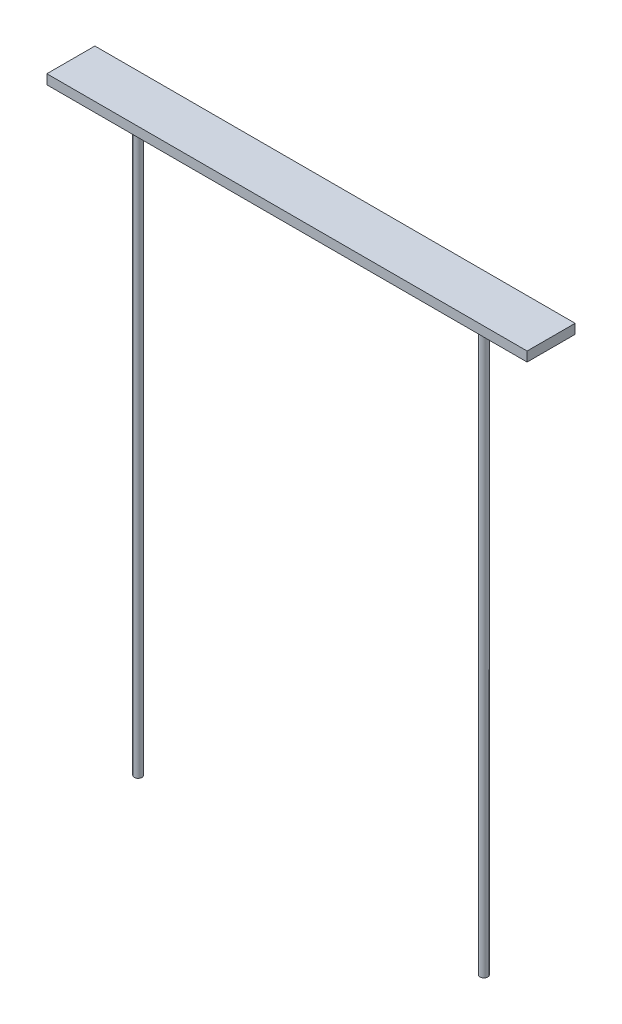
ISO-10303-21;
HEADER;
FILE_DESCRIPTION(('STEP AP214'),'2;1');
FILE_NAME('part.step','',(''),(''),'','','');
FILE_SCHEMA(('AUTOMOTIVE_DESIGN { 1 0 10303 214 1 1 1 1 }'));
ENDSEC;
DATA;
#1=APPLICATION_CONTEXT('core data for automotive mechanical design processes');
#2=APPLICATION_PROTOCOL_DEFINITION('international standard','automotive_design',2000,#1);
#3=PRODUCT_CONTEXT('',#1,'mechanical');
#4=PRODUCT('Part','Part','',(#3));
#5=PRODUCT_RELATED_PRODUCT_CATEGORY('part','',(#4));
#6=PRODUCT_DEFINITION_FORMATION('','',#4);
#7=PRODUCT_DEFINITION_CONTEXT('part definition',#1,'design');
#8=PRODUCT_DEFINITION('design','',#6,#7);
#9=PRODUCT_DEFINITION_SHAPE('','',#8);
#10=(LENGTH_UNIT() NAMED_UNIT(*) SI_UNIT(.MILLI.,.METRE.));
#11=(NAMED_UNIT(*) PLANE_ANGLE_UNIT() SI_UNIT($,.RADIAN.));
#12=(NAMED_UNIT(*) SI_UNIT($,.STERADIAN.) SOLID_ANGLE_UNIT());
#13=UNCERTAINTY_MEASURE_WITH_UNIT(LENGTH_MEASURE(1.E-05),#10,'distance_accuracy_value','');
#14=(GEOMETRIC_REPRESENTATION_CONTEXT(3) GLOBAL_UNCERTAINTY_ASSIGNED_CONTEXT((#13)) GLOBAL_UNIT_ASSIGNED_CONTEXT((#10,
#11,#12)) REPRESENTATION_CONTEXT('',''));
#15=CARTESIAN_POINT('',(0.,0.,0.));
#16=DIRECTION('',(0.,0.,1.));
#17=DIRECTION('',(1.,0.,0.));
#18=AXIS2_PLACEMENT_3D('',#15,#16,#17);
#19=CARTESIAN_POINT('',(250.,10.,-25.));
#20=DIRECTION('',(-1.,0.,0.));
#21=DIRECTION('',(0.,0.,1.));
#22=AXIS2_PLACEMENT_3D('',#19,#20,#21);
#23=PLANE('',#22);
#24=DIRECTION('',(0.,0.,-1.));
#25=VECTOR('',#24,1.);
#26=CARTESIAN_POINT('',(250.,0.,-25.));
#27=LINE('',#26,#25);
#28=CARTESIAN_POINT('',(250.,0.,25.));
#29=VERTEX_POINT('',#28);
#30=CARTESIAN_POINT('',(250.,0.,-25.));
#31=VERTEX_POINT('',#30);
#32=EDGE_CURVE('E103',#29,#31,#27,.T.);
#33=ORIENTED_EDGE('',*,*,#32,.T.);
#34=DIRECTION('',(0.,-1.,0.));
#35=VECTOR('',#34,1.);
#36=CARTESIAN_POINT('',(250.,10.,-25.));
#37=LINE('',#36,#35);
#38=CARTESIAN_POINT('',(250.,10.,-25.));
#39=VERTEX_POINT('',#38);
#40=EDGE_CURVE('E94',#39,#31,#37,.T.);
#41=ORIENTED_EDGE('',*,*,#40,.F.);
#42=DIRECTION('',(0.,0.,-1.));
#43=VECTOR('',#42,1.);
#44=CARTESIAN_POINT('',(250.,10.,-25.));
#45=LINE('',#44,#43);
#46=CARTESIAN_POINT('',(250.,10.,25.));
#47=VERTEX_POINT('',#46);
#48=EDGE_CURVE('E88',#47,#39,#45,.T.);
#49=ORIENTED_EDGE('',*,*,#48,.F.);
#50=DIRECTION('',(0.,-1.,0.));
#51=VECTOR('',#50,1.);
#52=CARTESIAN_POINT('',(250.,10.,25.));
#53=LINE('',#52,#51);
#54=EDGE_CURVE('E99',#47,#29,#53,.T.);
#55=ORIENTED_EDGE('',*,*,#54,.T.);
#56=EDGE_LOOP('',(#33,#41,#49,#55));
#57=FACE_BOUND('',#56,.T.);
#58=ADVANCED_FACE('F36',(#57),#23,.F.);
#59=CARTESIAN_POINT('',(-250.,10.,-25.));
#60=DIRECTION('',(0.,0.,1.));
#61=DIRECTION('',(1.,0.,0.));
#62=AXIS2_PLACEMENT_3D('',#59,#60,#61);
#63=PLANE('',#62);
#64=DIRECTION('',(-1.,0.,0.));
#65=VECTOR('',#64,1.);
#66=CARTESIAN_POINT('',(-250.,0.,-25.));
#67=LINE('',#66,#65);
#68=CARTESIAN_POINT('',(-250.,0.,-25.));
#69=VERTEX_POINT('',#68);
#70=EDGE_CURVE('E93',#31,#69,#67,.T.);
#71=ORIENTED_EDGE('',*,*,#70,.T.);
#72=DIRECTION('',(0.,-1.,0.));
#73=VECTOR('',#72,1.);
#74=CARTESIAN_POINT('',(-250.,10.,-25.));
#75=LINE('',#74,#73);
#76=CARTESIAN_POINT('',(-250.,10.,-25.));
#77=VERTEX_POINT('',#76);
#78=EDGE_CURVE('E91',#77,#69,#75,.T.);
#79=ORIENTED_EDGE('',*,*,#78,.F.);
#80=DIRECTION('',(-1.,0.,0.));
#81=VECTOR('',#80,1.);
#82=CARTESIAN_POINT('',(-250.,10.,-25.));
#83=LINE('',#82,#81);
#84=EDGE_CURVE('E83',#39,#77,#83,.T.);
#85=ORIENTED_EDGE('',*,*,#84,.F.);
#86=ORIENTED_EDGE('',*,*,#40,.T.);
#87=EDGE_LOOP('',(#71,#79,#85,#86));
#88=FACE_BOUND('',#87,.T.);
#89=ADVANCED_FACE('F92',(#88),#63,.F.);
#90=CARTESIAN_POINT('',(-250.,10.,-25.));
#91=DIRECTION('',(1.,0.,0.));
#92=DIRECTION('',(0.,0.,-1.));
#93=AXIS2_PLACEMENT_3D('',#90,#91,#92);
#94=PLANE('',#93);
#95=DIRECTION('',(0.,0.,1.));
#96=VECTOR('',#95,1.);
#97=CARTESIAN_POINT('',(-250.,0.,-25.));
#98=LINE('',#97,#96);
#99=CARTESIAN_POINT('',(-250.,0.,25.));
#100=VERTEX_POINT('',#99);
#101=EDGE_CURVE('E69',#69,#100,#98,.T.);
#102=ORIENTED_EDGE('',*,*,#101,.T.);
#103=DIRECTION('',(0.,-1.,0.));
#104=VECTOR('',#103,1.);
#105=CARTESIAN_POINT('',(-250.,10.,25.));
#106=LINE('',#105,#104);
#107=CARTESIAN_POINT('',(-250.,10.,25.));
#108=VERTEX_POINT('',#107);
#109=EDGE_CURVE('E95',#108,#100,#106,.T.);
#110=ORIENTED_EDGE('',*,*,#109,.F.);
#111=DIRECTION('',(0.,0.,1.));
#112=VECTOR('',#111,1.);
#113=CARTESIAN_POINT('',(-250.,10.,-25.));
#114=LINE('',#113,#112);
#115=EDGE_CURVE('E86',#77,#108,#114,.T.);
#116=ORIENTED_EDGE('',*,*,#115,.F.);
#117=ORIENTED_EDGE('',*,*,#78,.T.);
#118=EDGE_LOOP('',(#102,#110,#116,#117));
#119=FACE_BOUND('',#118,.T.);
#120=ADVANCED_FACE('F97',(#119),#94,.F.);
#121=CARTESIAN_POINT('',(-250.,10.,25.));
#122=DIRECTION('',(0.,0.,-1.));
#123=DIRECTION('',(-1.,0.,0.));
#124=AXIS2_PLACEMENT_3D('',#121,#122,#123);
#125=PLANE('',#124);
#126=DIRECTION('',(1.,0.,0.));
#127=VECTOR('',#126,1.);
#128=CARTESIAN_POINT('',(-250.,0.,25.));
#129=LINE('',#128,#127);
#130=EDGE_CURVE('E75',#100,#29,#129,.T.);
#131=ORIENTED_EDGE('',*,*,#130,.T.);
#132=ORIENTED_EDGE('',*,*,#54,.F.);
#133=DIRECTION('',(1.,0.,0.));
#134=VECTOR('',#133,1.);
#135=CARTESIAN_POINT('',(-250.,10.,25.));
#136=LINE('',#135,#134);
#137=EDGE_CURVE('E52',#108,#47,#136,.T.);
#138=ORIENTED_EDGE('',*,*,#137,.F.);
#139=ORIENTED_EDGE('',*,*,#109,.T.);
#140=EDGE_LOOP('',(#131,#132,#138,#139));
#141=FACE_BOUND('',#140,.T.);
#142=ADVANCED_FACE('F124',(#141),#125,.F.);
#143=CARTESIAN_POINT('',(0.,10.,0.));
#144=DIRECTION('',(0.,1.,0.));
#145=DIRECTION('',(0.,0.,1.));
#146=AXIS2_PLACEMENT_3D('',#143,#144,#145);
#147=PLANE('',#146);
#148=ORIENTED_EDGE('',*,*,#48,.T.);
#149=ORIENTED_EDGE('',*,*,#84,.T.);
#150=ORIENTED_EDGE('',*,*,#115,.T.);
#151=ORIENTED_EDGE('',*,*,#137,.T.);
#152=EDGE_LOOP('',(#148,#149,#150,#151));
#153=FACE_BOUND('',#152,.T.);
#154=ADVANCED_FACE('F84',(#153),#147,.T.);
#155=CARTESIAN_POINT('',(0.,0.,0.));
#156=DIRECTION('',(0.,1.,0.));
#157=DIRECTION('',(0.,0.,1.));
#158=AXIS2_PLACEMENT_3D('',#155,#156,#157);
#159=PLANE('',#158);
#160=CARTESIAN_POINT('',(-180.,0.,0.));
#161=DIRECTION('',(0.,1.,0.));
#162=DIRECTION('',(0.,0.,1.));
#163=AXIS2_PLACEMENT_3D('',#160,#161,#162);
#164=CIRCLE('',#163,3.99999999999999);
#165=CARTESIAN_POINT('',(-180.,0.,3.99999999999999));
#166=VERTEX_POINT('',#165);
#167=EDGE_CURVE('E11',#166,#166,#164,.F.);
#168=ORIENTED_EDGE('',*,*,#167,.F.);
#169=EDGE_LOOP('',(#168));
#170=FACE_BOUND('',#169,.T.);
#171=CARTESIAN_POINT('',(180.,0.,0.));
#172=DIRECTION('',(0.,1.,0.));
#173=DIRECTION('',(0.,0.,1.));
#174=AXIS2_PLACEMENT_3D('',#171,#172,#173);
#175=CIRCLE('',#174,3.99999999999999);
#176=CARTESIAN_POINT('',(180.,0.,3.99999999999999));
#177=VERTEX_POINT('',#176);
#178=EDGE_CURVE('E44',#177,#177,#175,.F.);
#179=ORIENTED_EDGE('',*,*,#178,.F.);
#180=EDGE_LOOP('',(#179));
#181=FACE_BOUND('',#180,.T.);
#182=ORIENTED_EDGE('',*,*,#32,.F.);
#183=ORIENTED_EDGE('',*,*,#130,.F.);
#184=ORIENTED_EDGE('',*,*,#101,.F.);
#185=ORIENTED_EDGE('',*,*,#70,.F.);
#186=EDGE_LOOP('',(#182,#183,#184,#185));
#187=FACE_BOUND('',#186,.T.);
#188=ADVANCED_FACE('F117',(#170,#181,#187),#159,.F.);
#189=CARTESIAN_POINT('',(180.,-600.,0.));
#190=DIRECTION('',(0.,1.,0.));
#191=DIRECTION('',(0.,0.,1.));
#192=AXIS2_PLACEMENT_3D('',#189,#190,#191);
#193=CYLINDRICAL_SURFACE('',#192,3.99999999999999);
#194=CARTESIAN_POINT('',(180.,-600.,0.));
#195=DIRECTION('',(0.,-1.,0.));
#196=DIRECTION('',(0.,0.,-1.));
#197=AXIS2_PLACEMENT_3D('',#194,#195,#196);
#198=CIRCLE('',#197,3.99999999999999);
#199=CARTESIAN_POINT('',(180.,-600.,-3.99999999999999));
#200=VERTEX_POINT('',#199);
#201=EDGE_CURVE('E106',#200,#200,#198,.T.);
#202=ORIENTED_EDGE('',*,*,#201,.F.);
#203=EDGE_LOOP('',(#202));
#204=FACE_BOUND('',#203,.T.);
#205=ORIENTED_EDGE('',*,*,#178,.T.);
#206=EDGE_LOOP('',(#205));
#207=FACE_BOUND('',#206,.T.);
#208=ADVANCED_FACE('F115',(#204,#207),#193,.T.);
#209=CARTESIAN_POINT('',(180.,-600.,0.));
#210=DIRECTION('',(0.,-1.,0.));
#211=DIRECTION('',(0.,0.,-1.));
#212=AXIS2_PLACEMENT_3D('',#209,#210,#211);
#213=PLANE('',#212);
#214=ORIENTED_EDGE('',*,*,#201,.T.);
#215=EDGE_LOOP('',(#214));
#216=FACE_BOUND('',#215,.T.);
#217=ADVANCED_FACE('F164',(#216),#213,.T.);
#218=CARTESIAN_POINT('',(-180.,-600.,0.));
#219=DIRECTION('',(0.,1.,0.));
#220=DIRECTION('',(0.,0.,1.));
#221=AXIS2_PLACEMENT_3D('',#218,#219,#220);
#222=CYLINDRICAL_SURFACE('',#221,3.99999999999999);
#223=CARTESIAN_POINT('',(-180.,-600.,0.));
#224=DIRECTION('',(0.,-1.,0.));
#225=DIRECTION('',(0.,0.,-1.));
#226=AXIS2_PLACEMENT_3D('',#223,#224,#225);
#227=CIRCLE('',#226,3.99999999999999);
#228=CARTESIAN_POINT('',(-180.,-600.,-3.99999999999999));
#229=VERTEX_POINT('',#228);
#230=EDGE_CURVE('E207',#229,#229,#227,.T.);
#231=ORIENTED_EDGE('',*,*,#230,.F.);
#232=EDGE_LOOP('',(#231));
#233=FACE_BOUND('',#232,.T.);
#234=ORIENTED_EDGE('',*,*,#167,.T.);
#235=EDGE_LOOP('',(#234));
#236=FACE_BOUND('',#235,.T.);
#237=ADVANCED_FACE('F175',(#233,#236),#222,.T.);
#238=CARTESIAN_POINT('',(-180.,-600.,0.));
#239=DIRECTION('',(0.,-1.,0.));
#240=DIRECTION('',(0.,0.,-1.));
#241=AXIS2_PLACEMENT_3D('',#238,#239,#240);
#242=PLANE('',#241);
#243=ORIENTED_EDGE('',*,*,#230,.T.);
#244=EDGE_LOOP('',(#243));
#245=FACE_BOUND('',#244,.T.);
#246=ADVANCED_FACE('F190',(#245),#242,.T.);
#247=CLOSED_SHELL('',(#58,#89,#120,#142,#154,#188,#208,#217,#237,#246));
#248=MANIFOLD_SOLID_BREP('B2',#247);
#249=ADVANCED_BREP_SHAPE_REPRESENTATION('',(#18,#248),#14);
#250=SHAPE_DEFINITION_REPRESENTATION(#9,#249);
ENDSEC;
END-ISO-10303-21;
